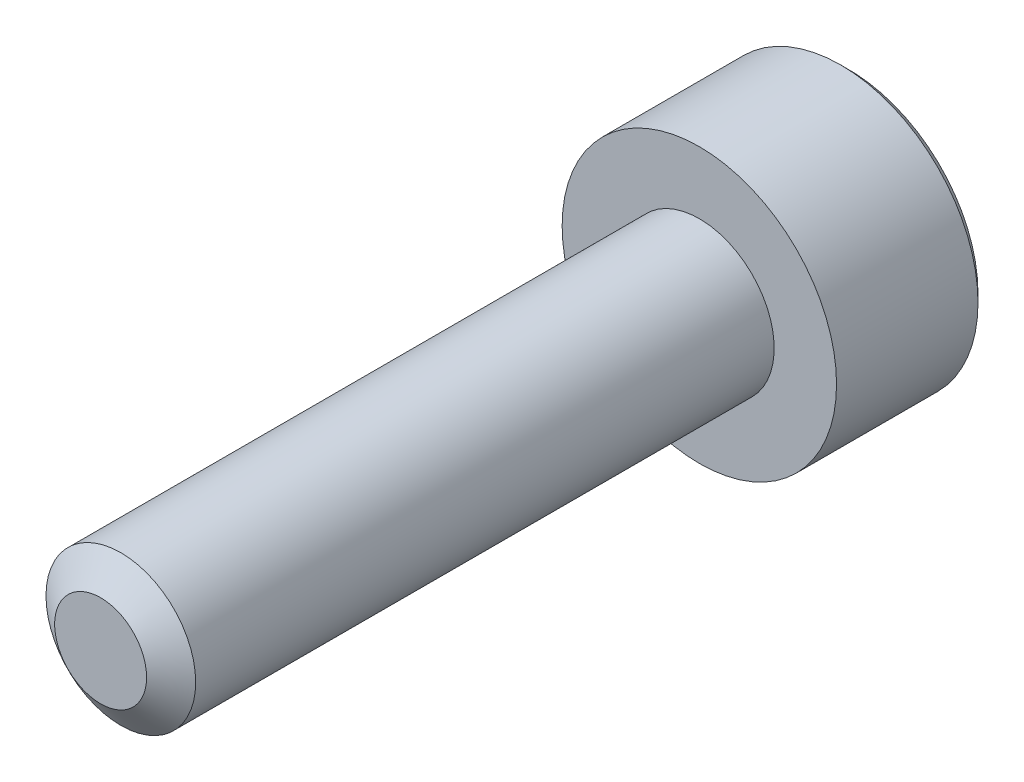
ISO-10303-21;
HEADER;
FILE_DESCRIPTION(('STEP AP214'),'2;1');
FILE_NAME('part.step','',(''),(''),'','','');
FILE_SCHEMA(('AUTOMOTIVE_DESIGN { 1 0 10303 214 1 1 1 1 }'));
ENDSEC;
DATA;
#1=APPLICATION_CONTEXT('core data for automotive mechanical design processes');
#2=APPLICATION_PROTOCOL_DEFINITION('international standard','automotive_design',2000,#1);
#3=PRODUCT_CONTEXT('',#1,'mechanical');
#4=PRODUCT('Part','Part','',(#3));
#5=PRODUCT_RELATED_PRODUCT_CATEGORY('part','',(#4));
#6=PRODUCT_DEFINITION_FORMATION('','',#4);
#7=PRODUCT_DEFINITION_CONTEXT('part definition',#1,'design');
#8=PRODUCT_DEFINITION('design','',#6,#7);
#9=PRODUCT_DEFINITION_SHAPE('','',#8);
#10=(LENGTH_UNIT() NAMED_UNIT(*) SI_UNIT(.MILLI.,.METRE.));
#11=(NAMED_UNIT(*) PLANE_ANGLE_UNIT() SI_UNIT($,.RADIAN.));
#12=(NAMED_UNIT(*) SI_UNIT($,.STERADIAN.) SOLID_ANGLE_UNIT());
#13=UNCERTAINTY_MEASURE_WITH_UNIT(LENGTH_MEASURE(1.E-05),#10,'distance_accuracy_value','');
#14=(GEOMETRIC_REPRESENTATION_CONTEXT(3) GLOBAL_UNCERTAINTY_ASSIGNED_CONTEXT((#13)) GLOBAL_UNIT_ASSIGNED_CONTEXT((#10,
#11,#12)) REPRESENTATION_CONTEXT('',''));
#15=CARTESIAN_POINT('',(0.,0.,0.));
#16=DIRECTION('',(0.,0.,1.));
#17=DIRECTION('',(1.,0.,0.));
#18=AXIS2_PLACEMENT_3D('',#15,#16,#17);
#19=CARTESIAN_POINT('',(0.,0.,0.));
#20=DIRECTION('',(0.,0.,1.));
#21=DIRECTION('',(1.,0.,0.));
#22=AXIS2_PLACEMENT_3D('',#19,#20,#21);
#23=PLANE('',#22);
#24=CARTESIAN_POINT('',(0.,0.,0.));
#25=DIRECTION('',(0.,0.,1.));
#26=DIRECTION('',(1.,0.,0.));
#27=AXIS2_PLACEMENT_3D('',#24,#25,#26);
#28=CIRCLE('',#27,0.921240473580834);
#29=CARTESIAN_POINT('',(0.921240473580834,0.,0.));
#30=VERTEX_POINT('',#29);
#31=EDGE_CURVE('E11',#30,#30,#28,.T.);
#32=ORIENTED_EDGE('',*,*,#31,.T.);
#33=EDGE_LOOP('',(#32));
#34=FACE_BOUND('',#33,.T.);
#35=ADVANCED_FACE('F16',(#34),#23,.T.);
#36=CARTESIAN_POINT('',(0.,0.,0.));
#37=DIRECTION('',(0.,0.,-1.));
#38=DIRECTION('',(-1.,0.,0.));
#39=AXIS2_PLACEMENT_3D('',#36,#37,#38);
#40=CONICAL_SURFACE('',#39,0.921240473580834,0.959931088596884);
#41=CARTESIAN_POINT('',(0.,0.,-0.405251783209379));
#42=DIRECTION('',(0.,0.,-1.));
#43=DIRECTION('',(1.,0.,0.));
#44=AXIS2_PLACEMENT_3D('',#41,#42,#43);
#45=CIRCLE('',#44,1.5);
#46=CARTESIAN_POINT('',(-1.5,0.,-0.405251783209379));
#47=VERTEX_POINT('',#46);
#48=CARTESIAN_POINT('',(1.5,0.,-0.40525178320938));
#49=VERTEX_POINT('',#48);
#50=EDGE_CURVE('E173',#47,#49,#45,.T.);
#51=ORIENTED_EDGE('',*,*,#50,.F.);
#52=CARTESIAN_POINT('',(0.,0.,-0.405251783209379));
#53=DIRECTION('',(0.,0.,-1.));
#54=DIRECTION('',(1.,0.,0.));
#55=AXIS2_PLACEMENT_3D('',#52,#53,#54);
#56=CIRCLE('',#55,1.5);
#57=EDGE_CURVE('E241',#49,#47,#56,.T.);
#58=ORIENTED_EDGE('',*,*,#57,.F.);
#59=DIRECTION('',(-0.819152044288993,0.,0.573576436351044));
#60=VECTOR('',#59,1.);
#61=CARTESIAN_POINT('',(0.921240473580834,0.,0.));
#62=LINE('',#61,#60);
#63=EDGE_CURVE('E25',#49,#30,#62,.T.);
#64=ORIENTED_EDGE('',*,*,#63,.T.);
#65=ORIENTED_EDGE('',*,*,#31,.F.);
#66=ORIENTED_EDGE('',*,*,#63,.F.);
#67=EDGE_LOOP('',(#51,#58,#64,#65,#66));
#68=FACE_BOUND('',#67,.T.);
#69=ADVANCED_FACE('F18',(#68),#40,.T.);
#70=CARTESIAN_POINT('',(0.,0.,-12.));
#71=DIRECTION('',(0.,0.,1.));
#72=DIRECTION('',(1.,0.,0.));
#73=AXIS2_PLACEMENT_3D('',#70,#71,#72);
#74=CYLINDRICAL_SURFACE('',#73,1.5);
#75=ORIENTED_EDGE('',*,*,#50,.T.);
#76=ORIENTED_EDGE('',*,*,#57,.T.);
#77=DIRECTION('',(0.,0.,-1.));
#78=VECTOR('',#77,1.);
#79=CARTESIAN_POINT('',(-1.5,0.,-12.));
#80=LINE('',#79,#78);
#81=CARTESIAN_POINT('',(-1.5,0.,-12.));
#82=VERTEX_POINT('',#81);
#83=EDGE_CURVE('E245',#47,#82,#80,.T.);
#84=ORIENTED_EDGE('',*,*,#83,.T.);
#85=CARTESIAN_POINT('',(0.,0.,-12.));
#86=DIRECTION('',(0.,0.,1.));
#87=DIRECTION('',(1.,0.,0.));
#88=AXIS2_PLACEMENT_3D('',#85,#86,#87);
#89=CIRCLE('',#88,1.5);
#90=EDGE_CURVE('E231',#82,#82,#89,.T.);
#91=ORIENTED_EDGE('',*,*,#90,.T.);
#92=ORIENTED_EDGE('',*,*,#83,.F.);
#93=EDGE_LOOP('',(#75,#76,#84,#91,#92));
#94=FACE_BOUND('',#93,.T.);
#95=ADVANCED_FACE('F250',(#94),#74,.T.);
#96=CARTESIAN_POINT('',(0.,0.,-15.));
#97=DIRECTION('',(0.,0.,1.));
#98=DIRECTION('',(1.,0.,0.));
#99=AXIS2_PLACEMENT_3D('',#96,#97,#98);
#100=CONICAL_SURFACE('',#99,2.585,0.785398163397446);
#101=CARTESIAN_POINT('',(0.,0.,-14.835));
#102=DIRECTION('',(0.,0.,1.));
#103=DIRECTION('',(-1.,0.,0.));
#104=AXIS2_PLACEMENT_3D('',#101,#102,#103);
#105=CIRCLE('',#104,2.75);
#106=CARTESIAN_POINT('',(-2.75,0.,-14.835));
#107=VERTEX_POINT('',#106);
#108=EDGE_CURVE('E268',#107,#107,#105,.T.);
#109=ORIENTED_EDGE('',*,*,#108,.F.);
#110=DIRECTION('',(0.707106781186546,0.,-0.707106781186549));
#111=VECTOR('',#110,1.);
#112=CARTESIAN_POINT('',(-2.585,0.,-15.));
#113=LINE('',#112,#111);
#114=CARTESIAN_POINT('',(-2.585,0.,-15.));
#115=VERTEX_POINT('',#114);
#116=EDGE_CURVE('E126',#107,#115,#113,.T.);
#117=ORIENTED_EDGE('',*,*,#116,.T.);
#118=CARTESIAN_POINT('',(0.,0.,-15.));
#119=DIRECTION('',(0.,0.,-1.));
#120=DIRECTION('',(-1.,0.,0.));
#121=AXIS2_PLACEMENT_3D('',#118,#119,#120);
#122=CIRCLE('',#121,2.585);
#123=EDGE_CURVE('E127',#115,#115,#122,.T.);
#124=ORIENTED_EDGE('',*,*,#123,.F.);
#125=ORIENTED_EDGE('',*,*,#116,.F.);
#126=EDGE_LOOP('',(#109,#117,#124,#125));
#127=FACE_BOUND('',#126,.T.);
#128=ADVANCED_FACE('F345',(#127),#100,.T.);
#129=CARTESIAN_POINT('',(0.,0.,-15.));
#130=DIRECTION('',(0.,0.,-1.));
#131=DIRECTION('',(-1.,0.,0.));
#132=AXIS2_PLACEMENT_3D('',#129,#130,#131);
#133=CONICAL_SURFACE('',#132,1.44337567297406,0.78539816339745);
#134=CARTESIAN_POINT('',(-1.25,-0.72168783648703,-15.));
#135=CARTESIAN_POINT('',(-1.25,0.,-14.6391560817565));
#136=CARTESIAN_POINT('',(-1.25,0.721687836487026,-15.));
#137=(BOUNDED_CURVE() B_SPLINE_CURVE(2,(#134,#135,#136),.UNSPECIFIED.,.F.,
.F.) B_SPLINE_CURVE_WITH_KNOTS((3,3),(-0.355324362692751,-0.127655147271297),
.UNSPECIFIED.) CURVE() GEOMETRIC_REPRESENTATION_ITEM() RATIONAL_B_SPLINE_CURVE((1.37128129211021,
1.58341924626905,1.37128129211021)) REPRESENTATION_ITEM(''));
#138=CARTESIAN_POINT('',(-1.25,-0.721687836487032,-15.));
#139=VERTEX_POINT('',#138);
#140=CARTESIAN_POINT('',(-1.25,0.721687836487032,-15.));
#141=VERTEX_POINT('',#140);
#142=EDGE_CURVE('E149',#139,#141,#137,.T.);
#143=ORIENTED_EDGE('',*,*,#142,.F.);
#144=CARTESIAN_POINT('',(0.,0.,-15.));
#145=DIRECTION('',(0.,0.,-1.));
#146=DIRECTION('',(-1.,0.,0.));
#147=AXIS2_PLACEMENT_3D('',#144,#145,#146);
#148=CIRCLE('',#147,1.44337567297406);
#149=EDGE_CURVE('E113',#139,#141,#148,.T.);
#150=ORIENTED_EDGE('',*,*,#149,.T.);
#151=EDGE_LOOP('',(#143,#150));
#152=FACE_BOUND('',#151,.T.);
#153=ADVANCED_FACE('F150',(#152),#133,.F.);
#154=CARTESIAN_POINT('',(0.,0.,-15.));
#155=DIRECTION('',(0.,0.,-1.));
#156=DIRECTION('',(0.,-1.,0.));
#157=AXIS2_PLACEMENT_3D('',#154,#155,#156);
#158=PLANE('',#157);
#159=CARTESIAN_POINT('',(0.,0.,-15.));
#160=DIRECTION('',(0.,0.,-1.));
#161=DIRECTION('',(-1.,0.,0.));
#162=AXIS2_PLACEMENT_3D('',#159,#160,#161);
#163=CIRCLE('',#162,1.44337567297406);
#164=CARTESIAN_POINT('',(0.,1.44337567297407,-15.));
#165=VERTEX_POINT('',#164);
#166=EDGE_CURVE('E121',#141,#165,#163,.T.);
#167=ORIENTED_EDGE('',*,*,#166,.F.);
#168=ORIENTED_EDGE('',*,*,#149,.F.);
#169=CARTESIAN_POINT('',(0.,0.,-15.));
#170=DIRECTION('',(0.,0.,-1.));
#171=DIRECTION('',(-1.,0.,0.));
#172=AXIS2_PLACEMENT_3D('',#169,#170,#171);
#173=CIRCLE('',#172,1.44337567297406);
#174=CARTESIAN_POINT('',(0.,-1.44337567297407,-15.));
#175=VERTEX_POINT('',#174);
#176=EDGE_CURVE('E118',#175,#139,#173,.T.);
#177=ORIENTED_EDGE('',*,*,#176,.F.);
#178=CARTESIAN_POINT('',(0.,0.,-15.));
#179=DIRECTION('',(0.,0.,-1.));
#180=DIRECTION('',(-1.,0.,0.));
#181=AXIS2_PLACEMENT_3D('',#178,#179,#180);
#182=CIRCLE('',#181,1.44337567297406);
#183=CARTESIAN_POINT('',(1.25,-0.721687836487032,-15.));
#184=VERTEX_POINT('',#183);
#185=EDGE_CURVE('E136',#184,#175,#182,.T.);
#186=ORIENTED_EDGE('',*,*,#185,.F.);
#187=CARTESIAN_POINT('',(0.,0.,-15.));
#188=DIRECTION('',(0.,0.,-1.));
#189=DIRECTION('',(-1.,0.,0.));
#190=AXIS2_PLACEMENT_3D('',#187,#188,#189);
#191=CIRCLE('',#190,1.44337567297406);
#192=CARTESIAN_POINT('',(1.25,0.721687836487033,-15.));
#193=VERTEX_POINT('',#192);
#194=EDGE_CURVE('E225',#193,#184,#191,.T.);
#195=ORIENTED_EDGE('',*,*,#194,.F.);
#196=CARTESIAN_POINT('',(0.,0.,-15.));
#197=DIRECTION('',(0.,0.,-1.));
#198=DIRECTION('',(-1.,0.,0.));
#199=AXIS2_PLACEMENT_3D('',#196,#197,#198);
#200=CIRCLE('',#199,1.44337567297406);
#201=EDGE_CURVE('E228',#165,#193,#200,.T.);
#202=ORIENTED_EDGE('',*,*,#201,.F.);
#203=EDGE_LOOP('',(#167,#168,#177,#186,#195,#202));
#204=FACE_BOUND('',#203,.T.);
#205=ORIENTED_EDGE('',*,*,#123,.T.);
#206=EDGE_LOOP('',(#205));
#207=FACE_BOUND('',#206,.T.);
#208=ADVANCED_FACE('F115',(#204,#207),#158,.T.);
#209=CARTESIAN_POINT('',(0.,0.,-12.));
#210=DIRECTION('',(0.,0.,-1.));
#211=DIRECTION('',(0.,-1.,0.));
#212=AXIS2_PLACEMENT_3D('',#209,#210,#211);
#213=PLANE('',#212);
#214=ORIENTED_EDGE('',*,*,#90,.F.);
#215=EDGE_LOOP('',(#214));
#216=FACE_BOUND('',#215,.T.);
#217=CARTESIAN_POINT('',(0.,0.,-12.));
#218=DIRECTION('',(0.,0.,1.));
#219=DIRECTION('',(1.,0.,0.));
#220=AXIS2_PLACEMENT_3D('',#217,#218,#219);
#221=CIRCLE('',#220,2.75);
#222=CARTESIAN_POINT('',(-2.75,0.,-12.));
#223=VERTEX_POINT('',#222);
#224=EDGE_CURVE('E260',#223,#223,#221,.T.);
#225=ORIENTED_EDGE('',*,*,#224,.T.);
#226=EDGE_LOOP('',(#225));
#227=FACE_BOUND('',#226,.T.);
#228=ADVANCED_FACE('F253',(#216,#227),#213,.F.);
#229=CARTESIAN_POINT('',(0.,0.,-15.));
#230=DIRECTION('',(0.,0.,-1.));
#231=DIRECTION('',(-1.,0.,0.));
#232=AXIS2_PLACEMENT_3D('',#229,#230,#231);
#233=CONICAL_SURFACE('',#232,1.44337567297406,0.78539816339745);
#234=ORIENTED_EDGE('',*,*,#201,.T.);
#235=CARTESIAN_POINT('',(0.,1.44337567297406,-15.));
#236=CARTESIAN_POINT('',(0.625000000000001,1.08253175473055,-14.6391560817565));
#237=CARTESIAN_POINT('',(1.25,0.721687836487035,-15.));
#238=(BOUNDED_CURVE() B_SPLINE_CURVE(2,(#235,#236,#237),.UNSPECIFIED.,.F.,
.F.) B_SPLINE_CURVE_WITH_KNOTS((3,3),(-0.35532436269275,-0.127655147271297),
.UNSPECIFIED.) CURVE() GEOMETRIC_REPRESENTATION_ITEM() RATIONAL_B_SPLINE_CURVE((1.37128129211021,
1.58341924626904,1.3712812921102)) REPRESENTATION_ITEM(''));
#239=EDGE_CURVE('E208',#165,#193,#238,.T.);
#240=ORIENTED_EDGE('',*,*,#239,.F.);
#241=EDGE_LOOP('',(#234,#240));
#242=FACE_BOUND('',#241,.T.);
#243=ADVANCED_FACE('F256',(#242),#233,.F.);
#244=CARTESIAN_POINT('',(0.,0.,-15.));
#245=DIRECTION('',(0.,0.,-1.));
#246=DIRECTION('',(1.,0.,0.));
#247=AXIS2_PLACEMENT_3D('',#244,#245,#246);
#248=CONICAL_SURFACE('',#247,1.44337567297406,0.78539816339745);
#249=ORIENTED_EDGE('',*,*,#194,.T.);
#250=CARTESIAN_POINT('',(1.25,0.721687836487025,-15.));
#251=CARTESIAN_POINT('',(1.25,0.,-14.6391560817565));
#252=CARTESIAN_POINT('',(1.25,-0.721687836487027,-15.));
#253=(BOUNDED_CURVE() B_SPLINE_CURVE(2,(#250,#251,#252),.UNSPECIFIED.,.F.,
.F.) B_SPLINE_CURVE_WITH_KNOTS((3,3),(-0.35532436269275,-0.127655147271297),
.UNSPECIFIED.) CURVE() GEOMETRIC_REPRESENTATION_ITEM() RATIONAL_B_SPLINE_CURVE((1.3712812921102,
1.58341924626904,1.3712812921102)) REPRESENTATION_ITEM(''));
#254=EDGE_CURVE('E194',#193,#184,#253,.T.);
#255=ORIENTED_EDGE('',*,*,#254,.F.);
#256=EDGE_LOOP('',(#249,#255));
#257=FACE_BOUND('',#256,.T.);
#258=ADVANCED_FACE('F310',(#257),#248,.F.);
#259=CARTESIAN_POINT('',(0.,0.,-15.));
#260=DIRECTION('',(0.,0.,-1.));
#261=DIRECTION('',(-1.,0.,0.));
#262=AXIS2_PLACEMENT_3D('',#259,#260,#261);
#263=CONICAL_SURFACE('',#262,1.44337567297406,0.78539816339745);
#264=ORIENTED_EDGE('',*,*,#185,.T.);
#265=CARTESIAN_POINT('',(1.25,-0.721687836487034,-15.));
#266=CARTESIAN_POINT('',(0.625000000000001,-1.08253175473055,-14.6391560817565));
#267=CARTESIAN_POINT('',(0.,-1.44337567297406,-15.));
#268=(BOUNDED_CURVE() B_SPLINE_CURVE(2,(#265,#266,#267),.UNSPECIFIED.,.F.,
.F.) B_SPLINE_CURVE_WITH_KNOTS((3,3),(-0.355324362692751,-0.127655147271297),
.UNSPECIFIED.) CURVE() GEOMETRIC_REPRESENTATION_ITEM() RATIONAL_B_SPLINE_CURVE((1.37128129211021,
1.58341924626905,1.37128129211021)) REPRESENTATION_ITEM(''));
#269=EDGE_CURVE('E178',#184,#175,#268,.T.);
#270=ORIENTED_EDGE('',*,*,#269,.F.);
#271=EDGE_LOOP('',(#264,#270));
#272=FACE_BOUND('',#271,.T.);
#273=ADVANCED_FACE('F322',(#272),#263,.F.);
#274=CARTESIAN_POINT('',(0.,0.,-15.));
#275=DIRECTION('',(0.,0.,-1.));
#276=DIRECTION('',(-1.,0.,0.));
#277=AXIS2_PLACEMENT_3D('',#274,#275,#276);
#278=CONICAL_SURFACE('',#277,1.44337567297406,0.78539816339745);
#279=ORIENTED_EDGE('',*,*,#176,.T.);
#280=CARTESIAN_POINT('',(0.,-1.44337567297406,-15.));
#281=CARTESIAN_POINT('',(-0.625000000000001,-1.08253175473055,-14.6391560817565));
#282=CARTESIAN_POINT('',(-1.25,-0.721687836487035,-15.));
#283=(BOUNDED_CURVE() B_SPLINE_CURVE(2,(#280,#281,#282),.UNSPECIFIED.,.F.,
.F.) B_SPLINE_CURVE_WITH_KNOTS((3,3),(-0.35532436269275,-0.127655147271297),
.UNSPECIFIED.) CURVE() GEOMETRIC_REPRESENTATION_ITEM() RATIONAL_B_SPLINE_CURVE((1.37128129211021,
1.58341924626904,1.3712812921102)) REPRESENTATION_ITEM(''));
#284=EDGE_CURVE('E133',#175,#139,#283,.T.);
#285=ORIENTED_EDGE('',*,*,#284,.F.);
#286=EDGE_LOOP('',(#279,#285));
#287=FACE_BOUND('',#286,.T.);
#288=ADVANCED_FACE('F132',(#287),#278,.F.);
#289=CARTESIAN_POINT('',(0.,0.,-15.));
#290=DIRECTION('',(0.,0.,-1.));
#291=DIRECTION('',(-1.,0.,0.));
#292=AXIS2_PLACEMENT_3D('',#289,#290,#291);
#293=CONICAL_SURFACE('',#292,1.44337567297406,0.78539816339745);
#294=ORIENTED_EDGE('',*,*,#166,.T.);
#295=CARTESIAN_POINT('',(-1.25,0.721687836487036,-15.));
#296=CARTESIAN_POINT('',(-0.625,1.08253175473055,-14.6391560817565));
#297=CARTESIAN_POINT('',(0.,1.44337567297406,-15.));
#298=(BOUNDED_CURVE() B_SPLINE_CURVE(2,(#295,#296,#297),.UNSPECIFIED.,.F.,
.F.) B_SPLINE_CURVE_WITH_KNOTS((3,3),(-0.35532436269275,-0.127655147271297),
.UNSPECIFIED.) CURVE() GEOMETRIC_REPRESENTATION_ITEM() RATIONAL_B_SPLINE_CURVE((1.3712812921102,
1.58341924626904,1.3712812921102)) REPRESENTATION_ITEM(''));
#299=EDGE_CURVE('E277',#141,#165,#298,.T.);
#300=ORIENTED_EDGE('',*,*,#299,.F.);
#301=EDGE_LOOP('',(#294,#300));
#302=FACE_BOUND('',#301,.T.);
#303=ADVANCED_FACE('F306',(#302),#293,.F.);
#304=CARTESIAN_POINT('',(1.25,2.1650635094611,-13.125));
#305=DIRECTION('',(0.,0.,-1.));
#306=DIRECTION('',(0.,-1.,0.));
#307=AXIS2_PLACEMENT_3D('',#304,#305,#306);
#308=PLANE('',#307);
#309=DIRECTION('',(0.866025403784439,0.5,0.));
#310=VECTOR('',#309,1.);
#311=CARTESIAN_POINT('',(-1.25,0.721687836487032,-13.125));
#312=LINE('',#311,#310);
#313=CARTESIAN_POINT('',(-1.25,0.721687836487032,-13.125));
#314=VERTEX_POINT('',#313);
#315=CARTESIAN_POINT('',(0.,1.44337567297406,-13.125));
#316=VERTEX_POINT('',#315);
#317=EDGE_CURVE('E160',#314,#316,#312,.T.);
#318=ORIENTED_EDGE('',*,*,#317,.T.);
#319=DIRECTION('',(0.866025403784439,-0.5,0.));
#320=VECTOR('',#319,1.);
#321=CARTESIAN_POINT('',(0.,1.44337567297406,-13.125));
#322=LINE('',#321,#320);
#323=CARTESIAN_POINT('',(1.25,0.721687836487032,-13.125));
#324=VERTEX_POINT('',#323);
#325=EDGE_CURVE('E215',#316,#324,#322,.T.);
#326=ORIENTED_EDGE('',*,*,#325,.T.);
#327=DIRECTION('',(0.,-1.,0.));
#328=VECTOR('',#327,1.);
#329=CARTESIAN_POINT('',(1.25,0.721687836487032,-13.125));
#330=LINE('',#329,#328);
#331=CARTESIAN_POINT('',(1.25,-0.721687836487033,-13.125));
#332=VERTEX_POINT('',#331);
#333=EDGE_CURVE('E200',#324,#332,#330,.T.);
#334=ORIENTED_EDGE('',*,*,#333,.T.);
#335=DIRECTION('',(-0.866025403784439,-0.5,0.));
#336=VECTOR('',#335,1.);
#337=CARTESIAN_POINT('',(1.25,-0.721687836487033,-13.125));
#338=LINE('',#337,#336);
#339=CARTESIAN_POINT('',(0.,-1.44337567297406,-13.125));
#340=VERTEX_POINT('',#339);
#341=EDGE_CURVE('E183',#332,#340,#338,.T.);
#342=ORIENTED_EDGE('',*,*,#341,.T.);
#343=DIRECTION('',(-0.866025403784439,0.5,0.));
#344=VECTOR('',#343,1.);
#345=CARTESIAN_POINT('',(0.,-1.44337567297406,-13.125));
#346=LINE('',#345,#344);
#347=CARTESIAN_POINT('',(-1.25,-0.721687836487032,-13.125));
#348=VERTEX_POINT('',#347);
#349=EDGE_CURVE('E147',#340,#348,#346,.T.);
#350=ORIENTED_EDGE('',*,*,#349,.T.);
#351=DIRECTION('',(0.,1.,0.));
#352=VECTOR('',#351,1.);
#353=CARTESIAN_POINT('',(-1.25,-0.721687836487032,-13.125));
#354=LINE('',#353,#352);
#355=EDGE_CURVE('E155',#348,#314,#354,.T.);
#356=ORIENTED_EDGE('',*,*,#355,.T.);
#357=EDGE_LOOP('',(#318,#326,#334,#342,#350,#356));
#358=FACE_BOUND('',#357,.T.);
#359=ADVANCED_FACE('F318',(#358),#308,.T.);
#360=CARTESIAN_POINT('',(0.,1.44337567297406,-13.125));
#361=DIRECTION('',(0.5,0.866025403784439,0.));
#362=DIRECTION('',(0.,0.,-1.));
#363=AXIS2_PLACEMENT_3D('',#360,#361,#362);
#364=PLANE('',#363);
#365=DIRECTION('',(0.,0.,-1.));
#366=VECTOR('',#365,1.);
#367=CARTESIAN_POINT('',(0.,1.44337567297406,-13.125));
#368=LINE('',#367,#366);
#369=EDGE_CURVE('E166',#316,#165,#368,.T.);
#370=ORIENTED_EDGE('',*,*,#369,.T.);
#371=ORIENTED_EDGE('',*,*,#239,.T.);
#372=DIRECTION('',(0.,0.,-1.));
#373=VECTOR('',#372,1.);
#374=CARTESIAN_POINT('',(1.25,0.721687836487032,-13.125));
#375=LINE('',#374,#373);
#376=EDGE_CURVE('E193',#324,#193,#375,.T.);
#377=ORIENTED_EDGE('',*,*,#376,.F.);
#378=ORIENTED_EDGE('',*,*,#325,.F.);
#379=EDGE_LOOP('',(#370,#371,#377,#378));
#380=FACE_BOUND('',#379,.T.);
#381=ADVANCED_FACE('F298',(#380),#364,.F.);
#382=CARTESIAN_POINT('',(1.25,0.721687836487032,-13.125));
#383=DIRECTION('',(1.,0.,0.));
#384=DIRECTION('',(0.,1.,0.));
#385=AXIS2_PLACEMENT_3D('',#382,#383,#384);
#386=PLANE('',#385);
#387=ORIENTED_EDGE('',*,*,#376,.T.);
#388=ORIENTED_EDGE('',*,*,#254,.T.);
#389=DIRECTION('',(0.,0.,-1.));
#390=VECTOR('',#389,1.);
#391=CARTESIAN_POINT('',(1.25,-0.721687836487033,-13.125));
#392=LINE('',#391,#390);
#393=EDGE_CURVE('E184',#332,#184,#392,.T.);
#394=ORIENTED_EDGE('',*,*,#393,.F.);
#395=ORIENTED_EDGE('',*,*,#333,.F.);
#396=EDGE_LOOP('',(#387,#388,#394,#395));
#397=FACE_BOUND('',#396,.T.);
#398=ADVANCED_FACE('F315',(#397),#386,.F.);
#399=CARTESIAN_POINT('',(1.25,-0.721687836487033,-13.125));
#400=DIRECTION('',(0.5,-0.866025403784439,0.));
#401=DIRECTION('',(0.,0.,-1.));
#402=AXIS2_PLACEMENT_3D('',#399,#400,#401);
#403=PLANE('',#402);
#404=ORIENTED_EDGE('',*,*,#393,.T.);
#405=ORIENTED_EDGE('',*,*,#269,.T.);
#406=DIRECTION('',(0.,0.,-1.));
#407=VECTOR('',#406,1.);
#408=CARTESIAN_POINT('',(0.,-1.44337567297406,-13.125));
#409=LINE('',#408,#407);
#410=EDGE_CURVE('E145',#340,#175,#409,.T.);
#411=ORIENTED_EDGE('',*,*,#410,.F.);
#412=ORIENTED_EDGE('',*,*,#341,.F.);
#413=EDGE_LOOP('',(#404,#405,#411,#412));
#414=FACE_BOUND('',#413,.T.);
#415=ADVANCED_FACE('F320',(#414),#403,.F.);
#416=CARTESIAN_POINT('',(0.,-1.44337567297406,-13.125));
#417=DIRECTION('',(-0.5,-0.866025403784439,0.));
#418=DIRECTION('',(-0.866025403784439,0.5,0.));
#419=AXIS2_PLACEMENT_3D('',#416,#417,#418);
#420=PLANE('',#419);
#421=ORIENTED_EDGE('',*,*,#410,.T.);
#422=ORIENTED_EDGE('',*,*,#284,.T.);
#423=DIRECTION('',(0.,0.,-1.));
#424=VECTOR('',#423,1.);
#425=CARTESIAN_POINT('',(-1.25,-0.721687836487032,-13.125));
#426=LINE('',#425,#424);
#427=EDGE_CURVE('E143',#348,#139,#426,.T.);
#428=ORIENTED_EDGE('',*,*,#427,.F.);
#429=ORIENTED_EDGE('',*,*,#349,.F.);
#430=EDGE_LOOP('',(#421,#422,#428,#429));
#431=FACE_BOUND('',#430,.T.);
#432=ADVANCED_FACE('F140',(#431),#420,.F.);
#433=CARTESIAN_POINT('',(-1.25,-0.721687836487032,-13.125));
#434=DIRECTION('',(-1.,0.,0.));
#435=DIRECTION('',(0.,0.,1.));
#436=AXIS2_PLACEMENT_3D('',#433,#434,#435);
#437=PLANE('',#436);
#438=ORIENTED_EDGE('',*,*,#427,.T.);
#439=ORIENTED_EDGE('',*,*,#142,.T.);
#440=DIRECTION('',(0.,0.,-1.));
#441=VECTOR('',#440,1.);
#442=CARTESIAN_POINT('',(-1.25,0.721687836487032,-13.125));
#443=LINE('',#442,#441);
#444=EDGE_CURVE('E276',#314,#141,#443,.T.);
#445=ORIENTED_EDGE('',*,*,#444,.F.);
#446=ORIENTED_EDGE('',*,*,#355,.F.);
#447=EDGE_LOOP('',(#438,#439,#445,#446));
#448=FACE_BOUND('',#447,.T.);
#449=ADVANCED_FACE('F158',(#448),#437,.F.);
#450=CARTESIAN_POINT('',(-1.25,0.721687836487032,-13.125));
#451=DIRECTION('',(-0.5,0.866025403784439,0.));
#452=DIRECTION('',(0.,0.,1.));
#453=AXIS2_PLACEMENT_3D('',#450,#451,#452);
#454=PLANE('',#453);
#455=ORIENTED_EDGE('',*,*,#444,.T.);
#456=ORIENTED_EDGE('',*,*,#299,.T.);
#457=ORIENTED_EDGE('',*,*,#369,.F.);
#458=ORIENTED_EDGE('',*,*,#317,.F.);
#459=EDGE_LOOP('',(#455,#456,#457,#458));
#460=FACE_BOUND('',#459,.T.);
#461=ADVANCED_FACE('F304',(#460),#454,.F.);
#462=CARTESIAN_POINT('',(0.,0.,-15.));
#463=DIRECTION('',(0.,0.,1.));
#464=DIRECTION('',(1.,0.,0.));
#465=AXIS2_PLACEMENT_3D('',#462,#463,#464);
#466=CYLINDRICAL_SURFACE('',#465,2.75);
#467=ORIENTED_EDGE('',*,*,#224,.F.);
#468=DIRECTION('',(0.,0.,-1.));
#469=VECTOR('',#468,1.);
#470=CARTESIAN_POINT('',(-2.75,0.,-15.));
#471=LINE('',#470,#469);
#472=EDGE_CURVE('E264',#223,#107,#471,.T.);
#473=ORIENTED_EDGE('',*,*,#472,.T.);
#474=ORIENTED_EDGE('',*,*,#108,.T.);
#475=ORIENTED_EDGE('',*,*,#472,.F.);
#476=EDGE_LOOP('',(#467,#473,#474,#475));
#477=FACE_BOUND('',#476,.T.);
#478=ADVANCED_FACE('F388',(#477),#466,.T.);
#479=CLOSED_SHELL('',(#35,#69,#95,#128,#153,#208,#228,#243,#258,#273,#288,#303,#359,#381,#398,
#415,#432,#449,#461,#478));
#480=MANIFOLD_SOLID_BREP('B1',#479);
#481=ADVANCED_BREP_SHAPE_REPRESENTATION('',(#18,#480),#14);
#482=SHAPE_DEFINITION_REPRESENTATION(#9,#481);
ENDSEC;
END-ISO-10303-21;
